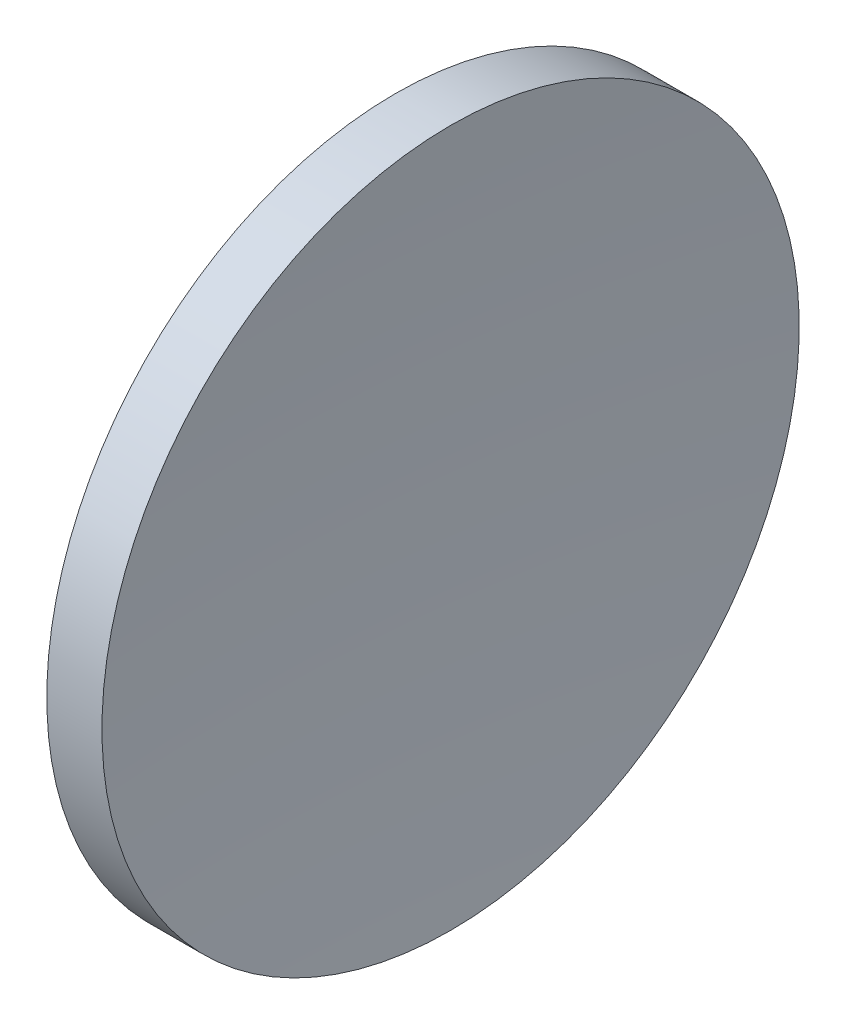
ISO-10303-21;
HEADER;
FILE_DESCRIPTION(('STEP AP214'),'2;1');
FILE_NAME('part.step','',(''),(''),'','','');
FILE_SCHEMA(('AUTOMOTIVE_DESIGN { 1 0 10303 214 1 1 1 1 }'));
ENDSEC;
DATA;
#1=APPLICATION_CONTEXT('core data for automotive mechanical design processes');
#2=APPLICATION_PROTOCOL_DEFINITION('international standard','automotive_design',2000,#1);
#3=PRODUCT_CONTEXT('',#1,'mechanical');
#4=PRODUCT('Part','Part','',(#3));
#5=PRODUCT_RELATED_PRODUCT_CATEGORY('part','',(#4));
#6=PRODUCT_DEFINITION_FORMATION('','',#4);
#7=PRODUCT_DEFINITION_CONTEXT('part definition',#1,'design');
#8=PRODUCT_DEFINITION('design','',#6,#7);
#9=PRODUCT_DEFINITION_SHAPE('','',#8);
#10=(LENGTH_UNIT() NAMED_UNIT(*) SI_UNIT(.MILLI.,.METRE.));
#11=(NAMED_UNIT(*) PLANE_ANGLE_UNIT() SI_UNIT($,.RADIAN.));
#12=(NAMED_UNIT(*) SI_UNIT($,.STERADIAN.) SOLID_ANGLE_UNIT());
#13=UNCERTAINTY_MEASURE_WITH_UNIT(LENGTH_MEASURE(1.E-05),#10,'distance_accuracy_value','');
#14=(GEOMETRIC_REPRESENTATION_CONTEXT(3) GLOBAL_UNCERTAINTY_ASSIGNED_CONTEXT((#13)) GLOBAL_UNIT_ASSIGNED_CONTEXT((#10,
#11,#12)) REPRESENTATION_CONTEXT('',''));
#15=CARTESIAN_POINT('',(0.,0.,0.));
#16=DIRECTION('',(0.,0.,1.));
#17=DIRECTION('',(1.,0.,0.));
#18=AXIS2_PLACEMENT_3D('',#15,#16,#17);
#19=CARTESIAN_POINT('',(363.155421315556,65.2168404709402,0.));
#20=DIRECTION('',(-1.,0.,0.));
#21=DIRECTION('',(0.,1.,0.));
#22=AXIS2_PLACEMENT_3D('',#19,#20,#21);
#23=SPHERICAL_SURFACE('',#22,236.);
#24=CARTESIAN_POINT('',(127.923515794642,65.2168404709403,0.));
#25=DIRECTION('',(-1.,0.,0.));
#26=DIRECTION('',(0.,-1.,0.));
#27=AXIS2_PLACEMENT_3D('',#24,#25,#26);
#28=CIRCLE('',#27,19.025);
#29=CARTESIAN_POINT('',(127.923515794642,46.1918404709404,0.));
#30=VERTEX_POINT('',#29);
#31=EDGE_CURVE('E10',#30,#30,#28,.T.);
#32=ORIENTED_EDGE('',*,*,#31,.F.);
#33=EDGE_LOOP('',(#32));
#34=FACE_BOUND('',#33,.T.);
#35=ADVANCED_FACE('F35',(#34),#23,.F.);
#36=CARTESIAN_POINT('',(115.944491297963,65.2168404709403,0.));
#37=DIRECTION('',(-1.,0.,0.));
#38=DIRECTION('',(0.,-1.,0.));
#39=AXIS2_PLACEMENT_3D('',#36,#37,#38);
#40=CYLINDRICAL_SURFACE('',#39,19.0249999999999);
#41=CARTESIAN_POINT('',(124.912627623381,65.2168404709403,0.));
#42=DIRECTION('',(-1.,0.,0.));
#43=DIRECTION('',(0.,-1.,0.));
#44=AXIS2_PLACEMENT_3D('',#41,#42,#43);
#45=CIRCLE('',#44,19.0249999999999);
#46=CARTESIAN_POINT('',(124.912627623381,46.1918404709404,0.));
#47=VERTEX_POINT('',#46);
#48=EDGE_CURVE('E41',#47,#47,#45,.T.);
#49=ORIENTED_EDGE('',*,*,#48,.F.);
#50=EDGE_LOOP('',(#49));
#51=FACE_BOUND('',#50,.T.);
#52=ORIENTED_EDGE('',*,*,#31,.T.);
#53=EDGE_LOOP('',(#52));
#54=FACE_BOUND('',#53,.T.);
#55=ADVANCED_FACE('F49',(#51,#54),#40,.T.);
#56=CARTESIAN_POINT('',(211.855421315556,65.2168404709403,0.));
#57=DIRECTION('',(-1.,0.,0.));
#58=DIRECTION('',(0.,1.,0.));
#59=AXIS2_PLACEMENT_3D('',#56,#57,#58);
#60=SPHERICAL_SURFACE('',#59,89.);
#61=ORIENTED_EDGE('',*,*,#48,.T.);
#62=EDGE_LOOP('',(#61));
#63=FACE_BOUND('',#62,.T.);
#64=ADVANCED_FACE('F47',(#63),#60,.T.);
#65=CLOSED_SHELL('',(#35,#55,#64));
#66=MANIFOLD_SOLID_BREP('B2',#65);
#67=ADVANCED_BREP_SHAPE_REPRESENTATION('',(#18,#66),#14);
#68=SHAPE_DEFINITION_REPRESENTATION(#9,#67);
ENDSEC;
END-ISO-10303-21;
